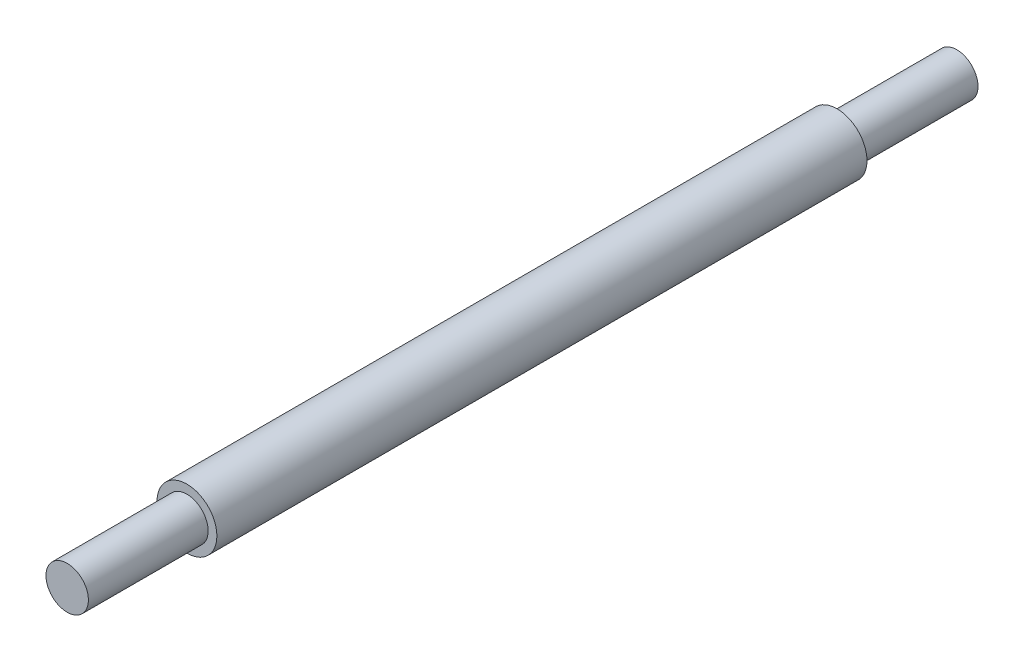
ISO-10303-21;
HEADER;
FILE_DESCRIPTION(('STEP AP214'),'2;1');
FILE_NAME('part.step','',(''),(''),'','','');
FILE_SCHEMA(('AUTOMOTIVE_DESIGN { 1 0 10303 214 1 1 1 1 }'));
ENDSEC;
DATA;
#1=APPLICATION_CONTEXT('core data for automotive mechanical design processes');
#2=APPLICATION_PROTOCOL_DEFINITION('international standard','automotive_design',2000,#1);
#3=PRODUCT_CONTEXT('',#1,'mechanical');
#4=PRODUCT('Part','Part','',(#3));
#5=PRODUCT_RELATED_PRODUCT_CATEGORY('part','',(#4));
#6=PRODUCT_DEFINITION_FORMATION('','',#4);
#7=PRODUCT_DEFINITION_CONTEXT('part definition',#1,'design');
#8=PRODUCT_DEFINITION('design','',#6,#7);
#9=PRODUCT_DEFINITION_SHAPE('','',#8);
#10=(LENGTH_UNIT() NAMED_UNIT(*) SI_UNIT(.MILLI.,.METRE.));
#11=(NAMED_UNIT(*) PLANE_ANGLE_UNIT() SI_UNIT($,.RADIAN.));
#12=(NAMED_UNIT(*) SI_UNIT($,.STERADIAN.) SOLID_ANGLE_UNIT());
#13=UNCERTAINTY_MEASURE_WITH_UNIT(LENGTH_MEASURE(1.E-05),#10,'distance_accuracy_value','');
#14=(GEOMETRIC_REPRESENTATION_CONTEXT(3) GLOBAL_UNCERTAINTY_ASSIGNED_CONTEXT((#13)) GLOBAL_UNIT_ASSIGNED_CONTEXT((#10,
#11,#12)) REPRESENTATION_CONTEXT('',''));
#15=CARTESIAN_POINT('',(0.,0.,0.));
#16=DIRECTION('',(0.,0.,1.));
#17=DIRECTION('',(1.,0.,0.));
#18=AXIS2_PLACEMENT_3D('',#15,#16,#17);
#19=CARTESIAN_POINT('',(0.,0.,-30.1625));
#20=DIRECTION('',(0.,0.,1.));
#21=DIRECTION('',(1.,0.,0.));
#22=AXIS2_PLACEMENT_3D('',#19,#20,#21);
#23=PLANE('',#22);
#24=CARTESIAN_POINT('',(0.,0.,-30.1625));
#25=DIRECTION('',(0.,0.,1.));
#26=DIRECTION('',(1.,0.,0.));
#27=AXIS2_PLACEMENT_3D('',#24,#25,#26);
#28=CIRCLE('',#27,2.778125);
#29=CARTESIAN_POINT('',(2.778125,0.,-30.1625));
#30=VERTEX_POINT('',#29);
#31=EDGE_CURVE('E41',#30,#30,#28,.T.);
#32=ORIENTED_EDGE('',*,*,#31,.F.);
#33=EDGE_LOOP('',(#32));
#34=FACE_BOUND('',#33,.T.);
#35=CARTESIAN_POINT('',(0.,0.,-30.1625));
#36=DIRECTION('',(0.,0.,1.));
#37=DIRECTION('',(1.,0.,0.));
#38=AXIS2_PLACEMENT_3D('',#35,#36,#37);
#39=CIRCLE('',#38,1.9685);
#40=CARTESIAN_POINT('',(1.9685,0.,-30.1625));
#41=VERTEX_POINT('',#40);
#42=EDGE_CURVE('E10',#41,#41,#39,.F.);
#43=ORIENTED_EDGE('',*,*,#42,.F.);
#44=EDGE_LOOP('',(#43));
#45=FACE_BOUND('',#44,.T.);
#46=ADVANCED_FACE('F30',(#34,#45),#23,.F.);
#47=CARTESIAN_POINT('',(0.,0.,30.1625));
#48=DIRECTION('',(0.,0.,1.));
#49=DIRECTION('',(1.,0.,0.));
#50=AXIS2_PLACEMENT_3D('',#47,#48,#49);
#51=PLANE('',#50);
#52=CARTESIAN_POINT('',(0.,0.,30.1625));
#53=DIRECTION('',(0.,0.,1.));
#54=DIRECTION('',(1.,0.,0.));
#55=AXIS2_PLACEMENT_3D('',#52,#53,#54);
#56=CIRCLE('',#55,2.778125);
#57=CARTESIAN_POINT('',(2.778125,0.,30.1625));
#58=VERTEX_POINT('',#57);
#59=EDGE_CURVE('E37',#58,#58,#56,.T.);
#60=ORIENTED_EDGE('',*,*,#59,.T.);
#61=EDGE_LOOP('',(#60));
#62=FACE_BOUND('',#61,.T.);
#63=CARTESIAN_POINT('',(0.,0.,30.1625));
#64=DIRECTION('',(0.,0.,1.));
#65=DIRECTION('',(1.,0.,0.));
#66=AXIS2_PLACEMENT_3D('',#63,#64,#65);
#67=CIRCLE('',#66,1.9685);
#68=CARTESIAN_POINT('',(1.9685,0.,30.1625));
#69=VERTEX_POINT('',#68);
#70=EDGE_CURVE('E48',#69,#69,#67,.T.);
#71=ORIENTED_EDGE('',*,*,#70,.F.);
#72=EDGE_LOOP('',(#71));
#73=FACE_BOUND('',#72,.T.);
#74=ADVANCED_FACE('F72',(#62,#73),#51,.T.);
#75=CARTESIAN_POINT('',(0.,0.,30.1625));
#76=DIRECTION('',(0.,0.,-1.));
#77=DIRECTION('',(-1.,0.,0.));
#78=AXIS2_PLACEMENT_3D('',#75,#76,#77);
#79=CYLINDRICAL_SURFACE('',#78,2.778125);
#80=ORIENTED_EDGE('',*,*,#59,.F.);
#81=EDGE_LOOP('',(#80));
#82=FACE_BOUND('',#81,.T.);
#83=ORIENTED_EDGE('',*,*,#31,.T.);
#84=EDGE_LOOP('',(#83));
#85=FACE_BOUND('',#84,.T.);
#86=ADVANCED_FACE('F32',(#82,#85),#79,.T.);
#87=CARTESIAN_POINT('',(0.,0.,41.275));
#88=DIRECTION('',(0.,0.,-1.));
#89=DIRECTION('',(-1.,0.,0.));
#90=AXIS2_PLACEMENT_3D('',#87,#88,#89);
#91=CYLINDRICAL_SURFACE('',#90,1.9685);
#92=CARTESIAN_POINT('',(0.,0.,41.275));
#93=DIRECTION('',(0.,0.,1.));
#94=DIRECTION('',(1.,0.,0.));
#95=AXIS2_PLACEMENT_3D('',#92,#93,#94);
#96=CIRCLE('',#95,1.9685);
#97=CARTESIAN_POINT('',(1.9685,0.,41.275));
#98=VERTEX_POINT('',#97);
#99=EDGE_CURVE('E46',#98,#98,#96,.T.);
#100=ORIENTED_EDGE('',*,*,#99,.F.);
#101=EDGE_LOOP('',(#100));
#102=FACE_BOUND('',#101,.T.);
#103=ORIENTED_EDGE('',*,*,#70,.T.);
#104=EDGE_LOOP('',(#103));
#105=FACE_BOUND('',#104,.T.);
#106=ADVANCED_FACE('F68',(#102,#105),#91,.T.);
#107=CARTESIAN_POINT('',(0.,0.,41.275));
#108=DIRECTION('',(0.,0.,1.));
#109=DIRECTION('',(1.,0.,0.));
#110=AXIS2_PLACEMENT_3D('',#107,#108,#109);
#111=PLANE('',#110);
#112=ORIENTED_EDGE('',*,*,#99,.T.);
#113=EDGE_LOOP('',(#112));
#114=FACE_BOUND('',#113,.T.);
#115=ADVANCED_FACE('F61',(#114),#111,.T.);
#116=CARTESIAN_POINT('',(0.,0.,-41.275));
#117=DIRECTION('',(0.,0.,1.));
#118=DIRECTION('',(1.,0.,0.));
#119=AXIS2_PLACEMENT_3D('',#116,#117,#118);
#120=CYLINDRICAL_SURFACE('',#119,1.9685);
#121=CARTESIAN_POINT('',(0.,0.,-41.275));
#122=DIRECTION('',(0.,0.,-1.));
#123=DIRECTION('',(-1.,0.,0.));
#124=AXIS2_PLACEMENT_3D('',#121,#122,#123);
#125=CIRCLE('',#124,1.9685);
#126=CARTESIAN_POINT('',(-1.9685,0.,-41.275));
#127=VERTEX_POINT('',#126);
#128=EDGE_CURVE('E51',#127,#127,#125,.T.);
#129=ORIENTED_EDGE('',*,*,#128,.F.);
#130=EDGE_LOOP('',(#129));
#131=FACE_BOUND('',#130,.T.);
#132=ORIENTED_EDGE('',*,*,#42,.T.);
#133=EDGE_LOOP('',(#132));
#134=FACE_BOUND('',#133,.T.);
#135=ADVANCED_FACE('F59',(#131,#134),#120,.T.);
#136=CARTESIAN_POINT('',(0.,0.,-41.275));
#137=DIRECTION('',(0.,0.,-1.));
#138=DIRECTION('',(-1.,0.,0.));
#139=AXIS2_PLACEMENT_3D('',#136,#137,#138);
#140=PLANE('',#139);
#141=ORIENTED_EDGE('',*,*,#128,.T.);
#142=EDGE_LOOP('',(#141));
#143=FACE_BOUND('',#142,.T.);
#144=ADVANCED_FACE('F57',(#143),#140,.T.);
#145=CLOSED_SHELL('',(#46,#74,#86,#106,#115,#135,#144));
#146=MANIFOLD_SOLID_BREP('B2',#145);
#147=ADVANCED_BREP_SHAPE_REPRESENTATION('',(#18,#146),#14);
#148=SHAPE_DEFINITION_REPRESENTATION(#9,#147);
ENDSEC;
END-ISO-10303-21;
